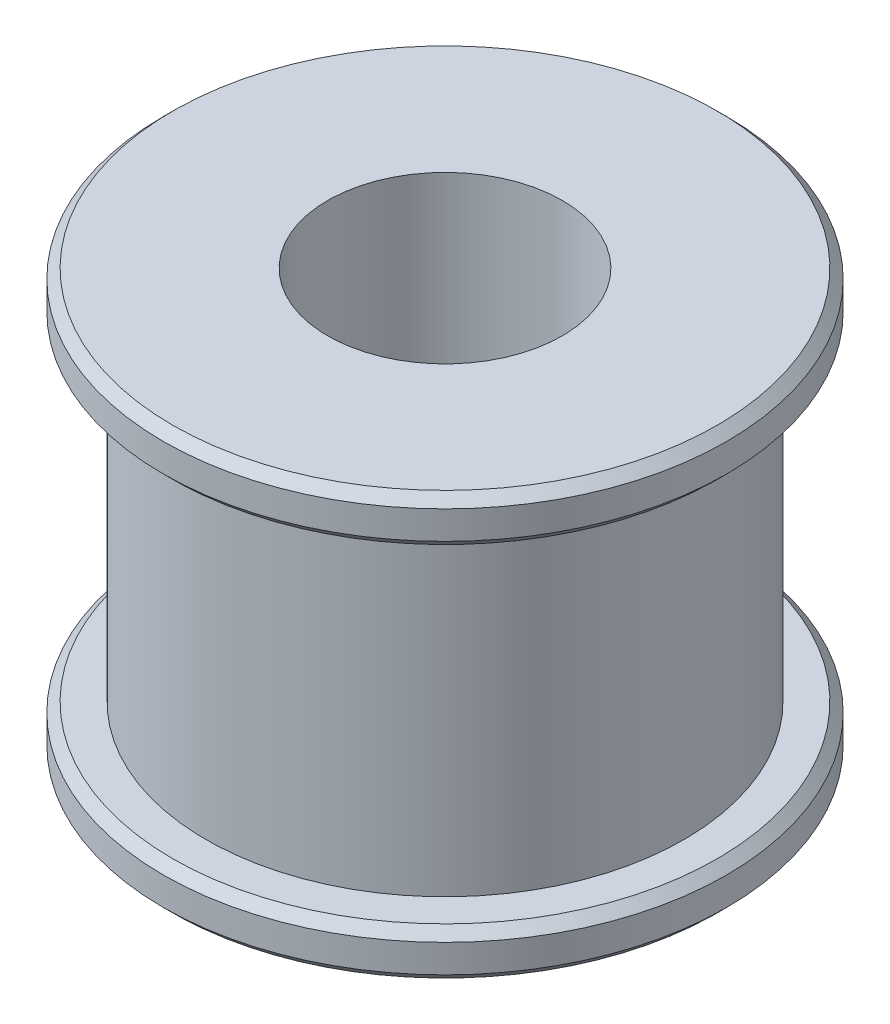
ISO-10303-21;
HEADER;
FILE_DESCRIPTION(('STEP AP214'),'2;1');
FILE_NAME('part.step','',(''),(''),'','','');
FILE_SCHEMA(('AUTOMOTIVE_DESIGN { 1 0 10303 214 1 1 1 1 }'));
ENDSEC;
DATA;
#1=APPLICATION_CONTEXT('core data for automotive mechanical design processes');
#2=APPLICATION_PROTOCOL_DEFINITION('international standard','automotive_design',2000,#1);
#3=PRODUCT_CONTEXT('',#1,'mechanical');
#4=PRODUCT('Part','Part','',(#3));
#5=PRODUCT_RELATED_PRODUCT_CATEGORY('part','',(#4));
#6=PRODUCT_DEFINITION_FORMATION('','',#4);
#7=PRODUCT_DEFINITION_CONTEXT('part definition',#1,'design');
#8=PRODUCT_DEFINITION('design','',#6,#7);
#9=PRODUCT_DEFINITION_SHAPE('','',#8);
#10=(LENGTH_UNIT() NAMED_UNIT(*) SI_UNIT(.MILLI.,.METRE.));
#11=(NAMED_UNIT(*) PLANE_ANGLE_UNIT() SI_UNIT($,.RADIAN.));
#12=(NAMED_UNIT(*) SI_UNIT($,.STERADIAN.) SOLID_ANGLE_UNIT());
#13=UNCERTAINTY_MEASURE_WITH_UNIT(LENGTH_MEASURE(1.E-05),#10,'distance_accuracy_value','');
#14=(GEOMETRIC_REPRESENTATION_CONTEXT(3) GLOBAL_UNCERTAINTY_ASSIGNED_CONTEXT((#13)) GLOBAL_UNIT_ASSIGNED_CONTEXT((#10,
#11,#12)) REPRESENTATION_CONTEXT('',''));
#15=CARTESIAN_POINT('',(0.,0.,0.));
#16=DIRECTION('',(0.,0.,1.));
#17=DIRECTION('',(1.,0.,0.));
#18=AXIS2_PLACEMENT_3D('',#15,#16,#17);
#19=CARTESIAN_POINT('',(6.,0.,0.));
#20=DIRECTION('',(0.,-1.,0.));
#21=DIRECTION('',(0.,0.,-1.));
#22=AXIS2_PLACEMENT_3D('',#19,#20,#21);
#23=PLANE('',#22);
#24=CARTESIAN_POINT('',(0.,0.,0.));
#25=DIRECTION('',(0.,-1.,0.));
#26=DIRECTION('',(0.,0.,-1.));
#27=AXIS2_PLACEMENT_3D('',#24,#25,#26);
#28=CIRCLE('',#27,5.8);
#29=CARTESIAN_POINT('',(0.,0.,-5.8));
#30=VERTEX_POINT('',#29);
#31=EDGE_CURVE('E64',#30,#30,#28,.T.);
#32=ORIENTED_EDGE('',*,*,#31,.T.);
#33=EDGE_LOOP('',(#32));
#34=FACE_BOUND('',#33,.T.);
#35=CARTESIAN_POINT('',(0.,0.,0.));
#36=DIRECTION('',(0.,-1.,0.));
#37=DIRECTION('',(0.,0.,-1.));
#38=AXIS2_PLACEMENT_3D('',#35,#36,#37);
#39=CIRCLE('',#38,2.5);
#40=CARTESIAN_POINT('',(0.,0.,-2.5));
#41=VERTEX_POINT('',#40);
#42=EDGE_CURVE('E67',#41,#41,#39,.T.);
#43=ORIENTED_EDGE('',*,*,#42,.F.);
#44=EDGE_LOOP('',(#43));
#45=FACE_BOUND('',#44,.T.);
#46=ADVANCED_FACE('F34',(#34,#45),#23,.T.);
#47=CARTESIAN_POINT('',(0.,0.,0.));
#48=DIRECTION('',(0.,-1.,0.));
#49=DIRECTION('',(0.,0.,-1.));
#50=AXIS2_PLACEMENT_3D('',#47,#48,#49);
#51=CYLINDRICAL_SURFACE('',#50,2.5);
#52=ORIENTED_EDGE('',*,*,#42,.T.);
#53=EDGE_LOOP('',(#52));
#54=FACE_BOUND('',#53,.T.);
#55=CARTESIAN_POINT('',(0.,9.,0.));
#56=DIRECTION('',(0.,-1.,0.));
#57=DIRECTION('',(0.,0.,-1.));
#58=AXIS2_PLACEMENT_3D('',#55,#56,#57);
#59=CIRCLE('',#58,2.5);
#60=CARTESIAN_POINT('',(0.,9.,-2.5));
#61=VERTEX_POINT('',#60);
#62=EDGE_CURVE('E70',#61,#61,#59,.T.);
#63=ORIENTED_EDGE('',*,*,#62,.F.);
#64=EDGE_LOOP('',(#63));
#65=FACE_BOUND('',#64,.T.);
#66=ADVANCED_FACE('F98',(#54,#65),#51,.F.);
#67=CARTESIAN_POINT('',(2.5,9.,0.));
#68=DIRECTION('',(0.,1.,0.));
#69=DIRECTION('',(0.,0.,1.));
#70=AXIS2_PLACEMENT_3D('',#67,#68,#69);
#71=PLANE('',#70);
#72=CARTESIAN_POINT('',(0.,9.,0.));
#73=DIRECTION('',(0.,1.,0.));
#74=DIRECTION('',(0.,0.,1.));
#75=AXIS2_PLACEMENT_3D('',#72,#73,#74);
#76=CIRCLE('',#75,5.8);
#77=CARTESIAN_POINT('',(0.,9.,5.8));
#78=VERTEX_POINT('',#77);
#79=EDGE_CURVE('E10',#78,#78,#76,.T.);
#80=ORIENTED_EDGE('',*,*,#79,.T.);
#81=EDGE_LOOP('',(#80));
#82=FACE_BOUND('',#81,.T.);
#83=ORIENTED_EDGE('',*,*,#62,.T.);
#84=EDGE_LOOP('',(#83));
#85=FACE_BOUND('',#84,.T.);
#86=ADVANCED_FACE('F104',(#82,#85),#71,.T.);
#87=CARTESIAN_POINT('',(0.,0.,0.));
#88=DIRECTION('',(0.,-1.,0.));
#89=DIRECTION('',(0.,0.,-1.));
#90=AXIS2_PLACEMENT_3D('',#87,#88,#89);
#91=CYLINDRICAL_SURFACE('',#90,6.);
#92=CARTESIAN_POINT('',(0.,8.2,0.));
#93=DIRECTION('',(0.,-1.,0.));
#94=DIRECTION('',(0.,0.,-1.));
#95=AXIS2_PLACEMENT_3D('',#92,#93,#94);
#96=CIRCLE('',#95,6.);
#97=CARTESIAN_POINT('',(0.,8.2,-6.));
#98=VERTEX_POINT('',#97);
#99=EDGE_CURVE('E42',#98,#98,#96,.F.);
#100=ORIENTED_EDGE('',*,*,#99,.T.);
#101=EDGE_LOOP('',(#100));
#102=FACE_BOUND('',#101,.T.);
#103=CARTESIAN_POINT('',(0.,8.8,0.));
#104=DIRECTION('',(0.,1.,0.));
#105=DIRECTION('',(0.,0.,1.));
#106=AXIS2_PLACEMENT_3D('',#103,#104,#105);
#107=CIRCLE('',#106,6.);
#108=CARTESIAN_POINT('',(0.,8.8,6.));
#109=VERTEX_POINT('',#108);
#110=EDGE_CURVE('E46',#109,#109,#107,.F.);
#111=ORIENTED_EDGE('',*,*,#110,.T.);
#112=EDGE_LOOP('',(#111));
#113=FACE_BOUND('',#112,.T.);
#114=ADVANCED_FACE('F94',(#102,#113),#91,.T.);
#115=CARTESIAN_POINT('',(6.,8.,0.));
#116=DIRECTION('',(0.,-1.,0.));
#117=DIRECTION('',(0.,0.,-1.));
#118=AXIS2_PLACEMENT_3D('',#115,#116,#117);
#119=PLANE('',#118);
#120=CARTESIAN_POINT('',(0.,8.,0.));
#121=DIRECTION('',(0.,-1.,0.));
#122=DIRECTION('',(0.,0.,-1.));
#123=AXIS2_PLACEMENT_3D('',#120,#121,#122);
#124=CIRCLE('',#123,5.8);
#125=CARTESIAN_POINT('',(0.,8.,-5.8));
#126=VERTEX_POINT('',#125);
#127=EDGE_CURVE('E50',#126,#126,#124,.T.);
#128=ORIENTED_EDGE('',*,*,#127,.T.);
#129=EDGE_LOOP('',(#128));
#130=FACE_BOUND('',#129,.T.);
#131=CARTESIAN_POINT('',(0.,8.,0.));
#132=DIRECTION('',(0.,-1.,0.));
#133=DIRECTION('',(0.,0.,-1.));
#134=AXIS2_PLACEMENT_3D('',#131,#132,#133);
#135=CIRCLE('',#134,5.09295817894065);
#136=CARTESIAN_POINT('',(0.,8.,-5.09295817894065));
#137=VERTEX_POINT('',#136);
#138=EDGE_CURVE('E73',#137,#137,#135,.T.);
#139=ORIENTED_EDGE('',*,*,#138,.F.);
#140=EDGE_LOOP('',(#139));
#141=FACE_BOUND('',#140,.T.);
#142=ADVANCED_FACE('F84',(#130,#141),#119,.T.);
#143=CARTESIAN_POINT('',(0.,0.,0.));
#144=DIRECTION('',(0.,-1.,0.));
#145=DIRECTION('',(0.,0.,-1.));
#146=AXIS2_PLACEMENT_3D('',#143,#144,#145);
#147=CYLINDRICAL_SURFACE('',#146,5.09295817894065);
#148=ORIENTED_EDGE('',*,*,#138,.T.);
#149=EDGE_LOOP('',(#148));
#150=FACE_BOUND('',#149,.T.);
#151=CARTESIAN_POINT('',(0.,1.,0.));
#152=DIRECTION('',(0.,-1.,0.));
#153=DIRECTION('',(0.,0.,-1.));
#154=AXIS2_PLACEMENT_3D('',#151,#152,#153);
#155=CIRCLE('',#154,5.09295817894065);
#156=CARTESIAN_POINT('',(0.,1.,-5.09295817894065));
#157=VERTEX_POINT('',#156);
#158=EDGE_CURVE('E76',#157,#157,#155,.T.);
#159=ORIENTED_EDGE('',*,*,#158,.F.);
#160=EDGE_LOOP('',(#159));
#161=FACE_BOUND('',#160,.T.);
#162=ADVANCED_FACE('F82',(#150,#161),#147,.T.);
#163=CARTESIAN_POINT('',(5.09295817894065,1.,0.));
#164=DIRECTION('',(0.,1.,0.));
#165=DIRECTION('',(0.,0.,1.));
#166=AXIS2_PLACEMENT_3D('',#163,#164,#165);
#167=PLANE('',#166);
#168=CARTESIAN_POINT('',(0.,1.,0.));
#169=DIRECTION('',(0.,1.,0.));
#170=DIRECTION('',(0.,0.,1.));
#171=AXIS2_PLACEMENT_3D('',#168,#169,#170);
#172=CIRCLE('',#171,5.8);
#173=CARTESIAN_POINT('',(0.,1.,5.8));
#174=VERTEX_POINT('',#173);
#175=EDGE_CURVE('E55',#174,#174,#172,.T.);
#176=ORIENTED_EDGE('',*,*,#175,.T.);
#177=EDGE_LOOP('',(#176));
#178=FACE_BOUND('',#177,.T.);
#179=ORIENTED_EDGE('',*,*,#158,.T.);
#180=EDGE_LOOP('',(#179));
#181=FACE_BOUND('',#180,.T.);
#182=ADVANCED_FACE('F80',(#178,#181),#167,.T.);
#183=CARTESIAN_POINT('',(0.,0.,0.));
#184=DIRECTION('',(0.,-1.,0.));
#185=DIRECTION('',(0.,0.,-1.));
#186=AXIS2_PLACEMENT_3D('',#183,#184,#185);
#187=CYLINDRICAL_SURFACE('',#186,6.);
#188=CARTESIAN_POINT('',(0.,0.200000000000001,0.));
#189=DIRECTION('',(0.,-1.,0.));
#190=DIRECTION('',(0.,0.,-1.));
#191=AXIS2_PLACEMENT_3D('',#188,#189,#190);
#192=CIRCLE('',#191,6.);
#193=CARTESIAN_POINT('',(0.,0.200000000000001,-6.));
#194=VERTEX_POINT('',#193);
#195=EDGE_CURVE('E58',#194,#194,#192,.F.);
#196=ORIENTED_EDGE('',*,*,#195,.T.);
#197=EDGE_LOOP('',(#196));
#198=FACE_BOUND('',#197,.T.);
#199=CARTESIAN_POINT('',(0.,0.799999999999999,0.));
#200=DIRECTION('',(0.,1.,0.));
#201=DIRECTION('',(0.,0.,1.));
#202=AXIS2_PLACEMENT_3D('',#199,#200,#201);
#203=CIRCLE('',#202,6.);
#204=CARTESIAN_POINT('',(0.,0.799999999999999,6.));
#205=VERTEX_POINT('',#204);
#206=EDGE_CURVE('E61',#205,#205,#203,.F.);
#207=ORIENTED_EDGE('',*,*,#206,.T.);
#208=EDGE_LOOP('',(#207));
#209=FACE_BOUND('',#208,.T.);
#210=ADVANCED_FACE('F91',(#198,#209),#187,.T.);
#211=CARTESIAN_POINT('',(0.,0.,0.));
#212=DIRECTION('',(0.,1.,0.));
#213=DIRECTION('',(0.,0.,1.));
#214=AXIS2_PLACEMENT_3D('',#211,#212,#213);
#215=CONICAL_SURFACE('',#214,5.8,0.785398163397442);
#216=ORIENTED_EDGE('',*,*,#195,.F.);
#217=EDGE_LOOP('',(#216));
#218=FACE_BOUND('',#217,.T.);
#219=ORIENTED_EDGE('',*,*,#31,.F.);
#220=EDGE_LOOP('',(#219));
#221=FACE_BOUND('',#220,.T.);
#222=ADVANCED_FACE('F111',(#218,#221),#215,.T.);
#223=CARTESIAN_POINT('',(0.,0.799999999999999,0.));
#224=DIRECTION('',(0.,-1.,0.));
#225=DIRECTION('',(0.,0.,-1.));
#226=AXIS2_PLACEMENT_3D('',#223,#224,#225);
#227=CONICAL_SURFACE('',#226,6.,0.785398163397448);
#228=ORIENTED_EDGE('',*,*,#175,.F.);
#229=EDGE_LOOP('',(#228));
#230=FACE_BOUND('',#229,.T.);
#231=ORIENTED_EDGE('',*,*,#206,.F.);
#232=EDGE_LOOP('',(#231));
#233=FACE_BOUND('',#232,.T.);
#234=ADVANCED_FACE('F117',(#230,#233),#227,.T.);
#235=CARTESIAN_POINT('',(0.,8.,0.));
#236=DIRECTION('',(0.,1.,0.));
#237=DIRECTION('',(0.,0.,1.));
#238=AXIS2_PLACEMENT_3D('',#235,#236,#237);
#239=CONICAL_SURFACE('',#238,5.8,0.78539816339744);
#240=ORIENTED_EDGE('',*,*,#99,.F.);
#241=EDGE_LOOP('',(#240));
#242=FACE_BOUND('',#241,.T.);
#243=ORIENTED_EDGE('',*,*,#127,.F.);
#244=EDGE_LOOP('',(#243));
#245=FACE_BOUND('',#244,.T.);
#246=ADVANCED_FACE('F123',(#242,#245),#239,.T.);
#247=CARTESIAN_POINT('',(0.,8.8,0.));
#248=DIRECTION('',(0.,-1.,0.));
#249=DIRECTION('',(0.,0.,-1.));
#250=AXIS2_PLACEMENT_3D('',#247,#248,#249);
#251=CONICAL_SURFACE('',#250,6.,0.785398163397442);
#252=ORIENTED_EDGE('',*,*,#79,.F.);
#253=EDGE_LOOP('',(#252));
#254=FACE_BOUND('',#253,.T.);
#255=ORIENTED_EDGE('',*,*,#110,.F.);
#256=EDGE_LOOP('',(#255));
#257=FACE_BOUND('',#256,.T.);
#258=ADVANCED_FACE('F37',(#254,#257),#251,.T.);
#259=CLOSED_SHELL('',(#46,#66,#86,#114,#142,#162,#182,#210,#222,#234,#246,#258));
#260=MANIFOLD_SOLID_BREP('B2',#259);
#261=ADVANCED_BREP_SHAPE_REPRESENTATION('',(#18,#260),#14);
#262=SHAPE_DEFINITION_REPRESENTATION(#9,#261);
ENDSEC;
END-ISO-10303-21;
